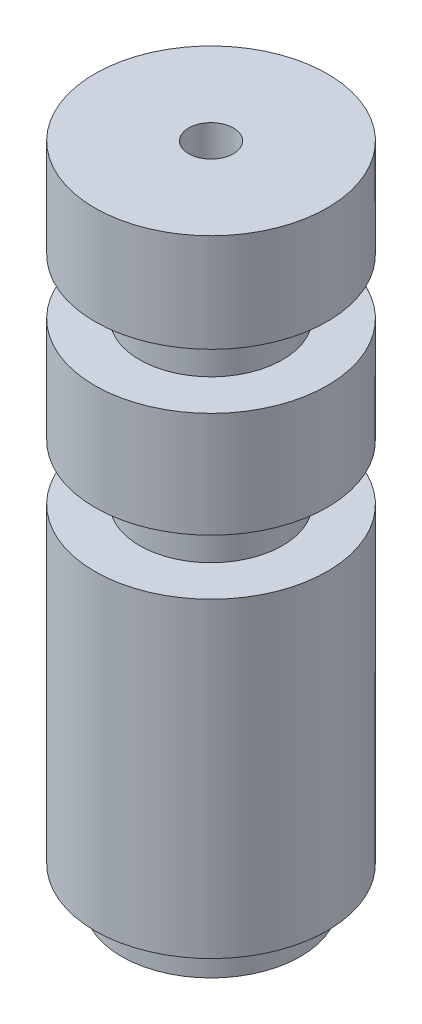
ISO-10303-21;
HEADER;
FILE_DESCRIPTION(('STEP AP214'),'2;1');
FILE_NAME('part.step','',(''),(''),'','','');
FILE_SCHEMA(('AUTOMOTIVE_DESIGN { 1 0 10303 214 1 1 1 1 }'));
ENDSEC;
DATA;
#1=APPLICATION_CONTEXT('core data for automotive mechanical design processes');
#2=APPLICATION_PROTOCOL_DEFINITION('international standard','automotive_design',2000,#1);
#3=PRODUCT_CONTEXT('',#1,'mechanical');
#4=PRODUCT('Part','Part','',(#3));
#5=PRODUCT_RELATED_PRODUCT_CATEGORY('part','',(#4));
#6=PRODUCT_DEFINITION_FORMATION('','',#4);
#7=PRODUCT_DEFINITION_CONTEXT('part definition',#1,'design');
#8=PRODUCT_DEFINITION('design','',#6,#7);
#9=PRODUCT_DEFINITION_SHAPE('','',#8);
#10=(LENGTH_UNIT() NAMED_UNIT(*) SI_UNIT(.MILLI.,.METRE.));
#11=(NAMED_UNIT(*) PLANE_ANGLE_UNIT() SI_UNIT($,.RADIAN.));
#12=(NAMED_UNIT(*) SI_UNIT($,.STERADIAN.) SOLID_ANGLE_UNIT());
#13=UNCERTAINTY_MEASURE_WITH_UNIT(LENGTH_MEASURE(1.E-05),#10,'distance_accuracy_value','');
#14=(GEOMETRIC_REPRESENTATION_CONTEXT(3) GLOBAL_UNCERTAINTY_ASSIGNED_CONTEXT((#13)) GLOBAL_UNIT_ASSIGNED_CONTEXT((#10,
#11,#12)) REPRESENTATION_CONTEXT('',''));
#15=CARTESIAN_POINT('',(0.,0.,0.));
#16=DIRECTION('',(0.,0.,1.));
#17=DIRECTION('',(1.,0.,0.));
#18=AXIS2_PLACEMENT_3D('',#15,#16,#17);
#19=CARTESIAN_POINT('',(0.,0.,0.));
#20=DIRECTION('',(0.,1.,0.));
#21=DIRECTION('',(0.,0.,1.));
#22=AXIS2_PLACEMENT_3D('',#19,#20,#21);
#23=PLANE('',#22);
#24=CARTESIAN_POINT('',(0.,0.,0.));
#25=DIRECTION('',(0.,1.,0.));
#26=DIRECTION('',(0.,0.,1.));
#27=AXIS2_PLACEMENT_3D('',#24,#25,#26);
#28=CIRCLE('',#27,6.5);
#29=CARTESIAN_POINT('',(0.,0.,6.5));
#30=VERTEX_POINT('',#29);
#31=EDGE_CURVE('E45',#30,#30,#28,.T.);
#32=ORIENTED_EDGE('',*,*,#31,.F.);
#33=EDGE_LOOP('',(#32));
#34=FACE_BOUND('',#33,.T.);
#35=CARTESIAN_POINT('',(0.,0.,0.));
#36=DIRECTION('',(0.,1.,0.));
#37=DIRECTION('',(0.,0.,1.));
#38=AXIS2_PLACEMENT_3D('',#35,#36,#37);
#39=CIRCLE('',#38,5.);
#40=CARTESIAN_POINT('',(0.,0.,5.));
#41=VERTEX_POINT('',#40);
#42=EDGE_CURVE('E11',#41,#41,#39,.F.);
#43=ORIENTED_EDGE('',*,*,#42,.F.);
#44=EDGE_LOOP('',(#43));
#45=FACE_BOUND('',#44,.T.);
#46=ADVANCED_FACE('F34',(#34,#45),#23,.F.);
#47=CARTESIAN_POINT('',(0.,35.,0.));
#48=DIRECTION('',(0.,-1.,0.));
#49=DIRECTION('',(0.,0.,-1.));
#50=AXIS2_PLACEMENT_3D('',#47,#48,#49);
#51=CYLINDRICAL_SURFACE('',#50,6.5);
#52=CARTESIAN_POINT('',(0.,20.5,0.));
#53=DIRECTION('',(0.,1.,0.));
#54=DIRECTION('',(0.,0.,1.));
#55=AXIS2_PLACEMENT_3D('',#52,#53,#54);
#56=CIRCLE('',#55,6.5);
#57=CARTESIAN_POINT('',(0.,20.5,6.5));
#58=VERTEX_POINT('',#57);
#59=EDGE_CURVE('E58',#58,#58,#56,.T.);
#60=ORIENTED_EDGE('',*,*,#59,.T.);
#61=EDGE_LOOP('',(#60));
#62=FACE_BOUND('',#61,.T.);
#63=CARTESIAN_POINT('',(0.,26.4,0.));
#64=DIRECTION('',(0.,1.,0.));
#65=DIRECTION('',(0.,0.,1.));
#66=AXIS2_PLACEMENT_3D('',#63,#64,#65);
#67=CIRCLE('',#66,6.5);
#68=CARTESIAN_POINT('',(0.,26.4,6.5));
#69=VERTEX_POINT('',#68);
#70=EDGE_CURVE('E62',#69,#69,#67,.T.);
#71=ORIENTED_EDGE('',*,*,#70,.F.);
#72=EDGE_LOOP('',(#71));
#73=FACE_BOUND('',#72,.T.);
#74=ADVANCED_FACE('F107',(#62,#73),#51,.T.);
#75=ORIENTED_EDGE('',*,*,#31,.T.);
#76=EDGE_LOOP('',(#75));
#77=FACE_BOUND('',#76,.T.);
#78=CARTESIAN_POINT('',(0.,17.4,0.));
#79=DIRECTION('',(0.,1.,0.));
#80=DIRECTION('',(0.,0.,1.));
#81=AXIS2_PLACEMENT_3D('',#78,#79,#80);
#82=CIRCLE('',#81,6.5);
#83=CARTESIAN_POINT('',(0.,17.4,6.5));
#84=VERTEX_POINT('',#83);
#85=EDGE_CURVE('E55',#84,#84,#82,.T.);
#86=ORIENTED_EDGE('',*,*,#85,.F.);
#87=EDGE_LOOP('',(#86));
#88=FACE_BOUND('',#87,.T.);
#89=ADVANCED_FACE('F112',(#77,#88),#51,.T.);
#90=CARTESIAN_POINT('',(0.,29.5,0.));
#91=DIRECTION('',(0.,1.,0.));
#92=DIRECTION('',(0.,0.,1.));
#93=AXIS2_PLACEMENT_3D('',#90,#91,#92);
#94=CIRCLE('',#93,6.5);
#95=CARTESIAN_POINT('',(0.,29.5,6.5));
#96=VERTEX_POINT('',#95);
#97=EDGE_CURVE('E64',#96,#96,#94,.T.);
#98=ORIENTED_EDGE('',*,*,#97,.T.);
#99=EDGE_LOOP('',(#98));
#100=FACE_BOUND('',#99,.T.);
#101=CARTESIAN_POINT('',(0.,35.,0.));
#102=DIRECTION('',(0.,1.,0.));
#103=DIRECTION('',(0.,0.,1.));
#104=AXIS2_PLACEMENT_3D('',#101,#102,#103);
#105=CIRCLE('',#104,6.5);
#106=CARTESIAN_POINT('',(0.,35.,6.5));
#107=VERTEX_POINT('',#106);
#108=EDGE_CURVE('E41',#107,#107,#105,.T.);
#109=ORIENTED_EDGE('',*,*,#108,.F.);
#110=EDGE_LOOP('',(#109));
#111=FACE_BOUND('',#110,.T.);
#112=ADVANCED_FACE('F36',(#100,#111),#51,.T.);
#113=CARTESIAN_POINT('',(0.,35.,0.));
#114=DIRECTION('',(0.,1.,0.));
#115=DIRECTION('',(0.,0.,1.));
#116=AXIS2_PLACEMENT_3D('',#113,#114,#115);
#117=PLANE('',#116);
#118=CARTESIAN_POINT('',(0.,35.,0.));
#119=DIRECTION('',(0.,-1.,0.));
#120=DIRECTION('',(0.,0.,-1.));
#121=AXIS2_PLACEMENT_3D('',#118,#119,#120);
#122=CIRCLE('',#121,1.25);
#123=CARTESIAN_POINT('',(0.,35.,-1.25));
#124=VERTEX_POINT('',#123);
#125=EDGE_CURVE('E50',#124,#124,#122,.T.);
#126=ORIENTED_EDGE('',*,*,#125,.T.);
#127=EDGE_LOOP('',(#126));
#128=FACE_BOUND('',#127,.T.);
#129=ORIENTED_EDGE('',*,*,#108,.T.);
#130=EDGE_LOOP('',(#129));
#131=FACE_BOUND('',#130,.T.);
#132=ADVANCED_FACE('F117',(#128,#131),#117,.T.);
#133=CARTESIAN_POINT('',(0.,35.,0.));
#134=DIRECTION('',(0.,-1.,0.));
#135=DIRECTION('',(0.,0.,-1.));
#136=AXIS2_PLACEMENT_3D('',#133,#134,#135);
#137=CYLINDRICAL_SURFACE('',#136,1.25);
#138=ORIENTED_EDGE('',*,*,#125,.F.);
#139=EDGE_LOOP('',(#138));
#140=FACE_BOUND('',#139,.T.);
#141=CARTESIAN_POINT('',(0.,-2.,0.));
#142=DIRECTION('',(0.,-1.,0.));
#143=DIRECTION('',(0.,0.,-1.));
#144=AXIS2_PLACEMENT_3D('',#141,#142,#143);
#145=CIRCLE('',#144,1.25);
#146=CARTESIAN_POINT('',(0.,-2.,-1.25));
#147=VERTEX_POINT('',#146);
#148=EDGE_CURVE('E84',#147,#147,#145,.T.);
#149=ORIENTED_EDGE('',*,*,#148,.T.);
#150=EDGE_LOOP('',(#149));
#151=FACE_BOUND('',#150,.T.);
#152=ADVANCED_FACE('F88',(#140,#151),#137,.F.);
#153=CARTESIAN_POINT('',(0.,20.5,0.));
#154=DIRECTION('',(0.,1.,0.));
#155=DIRECTION('',(0.,0.,1.));
#156=AXIS2_PLACEMENT_3D('',#153,#154,#155);
#157=PLANE('',#156);
#158=CARTESIAN_POINT('',(0.,20.5,0.));
#159=DIRECTION('',(0.,-1.,0.));
#160=DIRECTION('',(0.,0.,-1.));
#161=AXIS2_PLACEMENT_3D('',#158,#159,#160);
#162=CIRCLE('',#161,4.);
#163=CARTESIAN_POINT('',(0.,20.5,-4.));
#164=VERTEX_POINT('',#163);
#165=EDGE_CURVE('E67',#164,#164,#162,.T.);
#166=ORIENTED_EDGE('',*,*,#165,.F.);
#167=EDGE_LOOP('',(#166));
#168=FACE_BOUND('',#167,.T.);
#169=ORIENTED_EDGE('',*,*,#59,.F.);
#170=EDGE_LOOP('',(#169));
#171=FACE_BOUND('',#170,.T.);
#172=ADVANCED_FACE('F123',(#168,#171),#157,.F.);
#173=CARTESIAN_POINT('',(0.,17.4,0.));
#174=DIRECTION('',(0.,1.,0.));
#175=DIRECTION('',(0.,0.,1.));
#176=AXIS2_PLACEMENT_3D('',#173,#174,#175);
#177=PLANE('',#176);
#178=CARTESIAN_POINT('',(0.,17.4,0.));
#179=DIRECTION('',(0.,-1.,0.));
#180=DIRECTION('',(0.,0.,-1.));
#181=AXIS2_PLACEMENT_3D('',#178,#179,#180);
#182=CIRCLE('',#181,4.);
#183=CARTESIAN_POINT('',(0.,17.4,-4.));
#184=VERTEX_POINT('',#183);
#185=EDGE_CURVE('E59',#184,#184,#182,.T.);
#186=ORIENTED_EDGE('',*,*,#185,.T.);
#187=EDGE_LOOP('',(#186));
#188=FACE_BOUND('',#187,.T.);
#189=ORIENTED_EDGE('',*,*,#85,.T.);
#190=EDGE_LOOP('',(#189));
#191=FACE_BOUND('',#190,.T.);
#192=ADVANCED_FACE('F127',(#188,#191),#177,.T.);
#193=CARTESIAN_POINT('',(0.,20.5,0.));
#194=DIRECTION('',(0.,-1.,0.));
#195=DIRECTION('',(0.,0.,-1.));
#196=AXIS2_PLACEMENT_3D('',#193,#194,#195);
#197=CYLINDRICAL_SURFACE('',#196,4.);
#198=CARTESIAN_POINT('',(0.,20.5,-4.));
#199=CARTESIAN_POINT('',(0.,20.4677083333333,-4.));
#200=CARTESIAN_POINT('',(0.,20.4354166666667,-4.));
#201=CARTESIAN_POINT('',(0.,20.3708333333333,-4.));
#202=CARTESIAN_POINT('',(0.,20.3385416666667,-4.));
#203=CARTESIAN_POINT('',(0.,20.2739583333333,-4.));
#204=CARTESIAN_POINT('',(0.,20.2416666666667,-4.));
#205=CARTESIAN_POINT('',(0.,20.1770833333333,-4.));
#206=CARTESIAN_POINT('',(0.,20.1447916666667,-4.));
#207=CARTESIAN_POINT('',(0.,20.0802083333333,-4.));
#208=CARTESIAN_POINT('',(0.,20.0479166666667,-4.));
#209=CARTESIAN_POINT('',(0.,19.9833333333333,-4.));
#210=CARTESIAN_POINT('',(0.,19.9510416666667,-4.));
#211=CARTESIAN_POINT('',(0.,19.8864583333333,-4.));
#212=CARTESIAN_POINT('',(0.,19.8541666666667,-4.));
#213=CARTESIAN_POINT('',(0.,19.7895833333333,-4.));
#214=CARTESIAN_POINT('',(0.,19.7572916666667,-4.));
#215=CARTESIAN_POINT('',(0.,19.6927083333333,-4.));
#216=CARTESIAN_POINT('',(0.,19.6604166666667,-4.));
#217=CARTESIAN_POINT('',(0.,19.5958333333333,-4.));
#218=CARTESIAN_POINT('',(0.,19.5635416666667,-4.));
#219=CARTESIAN_POINT('',(0.,19.4989583333333,-4.));
#220=CARTESIAN_POINT('',(0.,19.4666666666667,-4.));
#221=CARTESIAN_POINT('',(0.,19.4020833333333,-4.));
#222=CARTESIAN_POINT('',(0.,19.3697916666667,-4.));
#223=CARTESIAN_POINT('',(0.,19.3052083333333,-4.));
#224=CARTESIAN_POINT('',(0.,19.2729166666667,-4.));
#225=CARTESIAN_POINT('',(0.,19.2083333333333,-4.));
#226=CARTESIAN_POINT('',(0.,19.1760416666667,-4.));
#227=CARTESIAN_POINT('',(0.,19.1114583333333,-4.));
#228=CARTESIAN_POINT('',(0.,19.0791666666667,-4.));
#229=CARTESIAN_POINT('',(0.,19.0145833333333,-4.));
#230=CARTESIAN_POINT('',(0.,18.9822916666667,-4.));
#231=CARTESIAN_POINT('',(0.,18.9177083333333,-4.));
#232=CARTESIAN_POINT('',(0.,18.8854166666667,-4.));
#233=CARTESIAN_POINT('',(0.,18.8208333333333,-4.));
#234=CARTESIAN_POINT('',(0.,18.7885416666667,-4.));
#235=CARTESIAN_POINT('',(0.,18.7239583333333,-4.));
#236=CARTESIAN_POINT('',(0.,18.6916666666667,-4.));
#237=CARTESIAN_POINT('',(0.,18.6270833333333,-4.));
#238=CARTESIAN_POINT('',(0.,18.5947916666667,-4.));
#239=CARTESIAN_POINT('',(0.,18.5302083333333,-4.));
#240=CARTESIAN_POINT('',(0.,18.4979166666667,-4.));
#241=CARTESIAN_POINT('',(0.,18.4333333333333,-4.));
#242=CARTESIAN_POINT('',(0.,18.4010416666667,-4.));
#243=CARTESIAN_POINT('',(0.,18.3364583333333,-4.));
#244=CARTESIAN_POINT('',(0.,18.3041666666667,-4.));
#245=CARTESIAN_POINT('',(0.,18.2395833333333,-4.));
#246=CARTESIAN_POINT('',(0.,18.2072916666667,-4.));
#247=CARTESIAN_POINT('',(0.,18.1427083333333,-4.));
#248=CARTESIAN_POINT('',(0.,18.1104166666667,-4.));
#249=CARTESIAN_POINT('',(0.,18.0458333333333,-4.));
#250=CARTESIAN_POINT('',(0.,18.0135416666667,-4.));
#251=CARTESIAN_POINT('',(0.,17.9489583333333,-4.));
#252=CARTESIAN_POINT('',(0.,17.9166666666667,-4.));
#253=CARTESIAN_POINT('',(0.,17.8520833333333,-4.));
#254=CARTESIAN_POINT('',(0.,17.8197916666667,-4.));
#255=CARTESIAN_POINT('',(0.,17.7552083333333,-4.));
#256=CARTESIAN_POINT('',(0.,17.7229166666667,-4.));
#257=CARTESIAN_POINT('',(0.,17.6583333333333,-4.));
#258=CARTESIAN_POINT('',(0.,17.6260416666667,-4.));
#259=CARTESIAN_POINT('',(0.,17.5614583333333,-4.));
#260=CARTESIAN_POINT('',(0.,17.5291666666667,-4.));
#261=CARTESIAN_POINT('',(0.,17.4645833333333,-4.));
#262=CARTESIAN_POINT('',(0.,17.4322916666667,-4.));
#263=CARTESIAN_POINT('',(0.,17.4,-4.));
#264=B_SPLINE_CURVE_WITH_KNOTS('',3,(#198,#199,#200,#201,#202,#203,#204,#205,#206,#207,#208,
#209,#210,#211,#212,#213,#214,#215,#216,#217,#218,#219,#220,#221,#222,#223,#224,#225,#226,#227,
#228,#229,#230,#231,#232,#233,#234,#235,#236,#237,#238,#239,#240,#241,#242,#243,#244,#245,#246,
#247,#248,#249,#250,#251,#252,#253,#254,#255,#256,#257,#258,#259,#260,#261,#262,#263),
.UNSPECIFIED.,.F.,.F.,(4,2,2,2,2,2,2,2,2,2,2,2,2,2,2,2,2,2,2,2,2,2,2,2,2,2,2,2,2,2,2,2,4),(0.,
0.0968750000000032,0.193750000000003,0.290625000000003,0.387500000000002,0.484375000000002,
0.581250000000002,0.678125000000002,0.775000000000001,0.871875000000001,0.968750000000001,
1.065625,1.1625,1.259375,1.35625,1.453125,1.55,1.646875,1.74375,1.840625,1.9375,2.034375,
2.13125,2.228125,2.325,2.421875,2.51875,2.615625,2.7125,2.809375,2.90625,3.003125,3.1),.UNSPECIFIED.);
#265=EDGE_CURVE('BSEAM131',#164,#184,#264,.T.);
#266=ORIENTED_EDGE('',*,*,#165,.T.);
#267=ORIENTED_EDGE('',*,*,#185,.F.);
#268=ORIENTED_EDGE('',*,*,#265,.T.);
#269=ORIENTED_EDGE('',*,*,#265,.F.);
#270=EDGE_LOOP('',(#266,#268,#267,#269));
#271=FACE_BOUND('',#270,.T.);
#272=ADVANCED_FACE('F131',(#271),#197,.T.);
#273=CARTESIAN_POINT('',(0.,29.5,0.));
#274=DIRECTION('',(0.,1.,0.));
#275=DIRECTION('',(0.,0.,1.));
#276=AXIS2_PLACEMENT_3D('',#273,#274,#275);
#277=PLANE('',#276);
#278=CARTESIAN_POINT('',(0.,29.5,0.));
#279=DIRECTION('',(0.,-1.,0.));
#280=DIRECTION('',(0.,0.,-1.));
#281=AXIS2_PLACEMENT_3D('',#278,#279,#280);
#282=CIRCLE('',#281,4.);
#283=CARTESIAN_POINT('',(0.,29.5,-4.));
#284=VERTEX_POINT('',#283);
#285=EDGE_CURVE('E78',#284,#284,#282,.T.);
#286=ORIENTED_EDGE('',*,*,#285,.F.);
#287=EDGE_LOOP('',(#286));
#288=FACE_BOUND('',#287,.T.);
#289=ORIENTED_EDGE('',*,*,#97,.F.);
#290=EDGE_LOOP('',(#289));
#291=FACE_BOUND('',#290,.T.);
#292=ADVANCED_FACE('F135',(#288,#291),#277,.F.);
#293=CARTESIAN_POINT('',(0.,26.4,0.));
#294=DIRECTION('',(0.,1.,0.));
#295=DIRECTION('',(0.,0.,1.));
#296=AXIS2_PLACEMENT_3D('',#293,#294,#295);
#297=PLANE('',#296);
#298=CARTESIAN_POINT('',(0.,26.4,0.));
#299=DIRECTION('',(0.,-1.,0.));
#300=DIRECTION('',(0.,0.,-1.));
#301=AXIS2_PLACEMENT_3D('',#298,#299,#300);
#302=CIRCLE('',#301,4.);
#303=CARTESIAN_POINT('',(0.,26.4,-4.));
#304=VERTEX_POINT('',#303);
#305=EDGE_CURVE('E65',#304,#304,#302,.T.);
#306=ORIENTED_EDGE('',*,*,#305,.T.);
#307=EDGE_LOOP('',(#306));
#308=FACE_BOUND('',#307,.T.);
#309=ORIENTED_EDGE('',*,*,#70,.T.);
#310=EDGE_LOOP('',(#309));
#311=FACE_BOUND('',#310,.T.);
#312=ADVANCED_FACE('F103',(#308,#311),#297,.T.);
#313=CARTESIAN_POINT('',(0.,29.5,0.));
#314=DIRECTION('',(0.,-1.,0.));
#315=DIRECTION('',(0.,0.,-1.));
#316=AXIS2_PLACEMENT_3D('',#313,#314,#315);
#317=CYLINDRICAL_SURFACE('',#316,4.);
#318=CARTESIAN_POINT('',(0.,29.5,-4.));
#319=CARTESIAN_POINT('',(0.,29.4677083333333,-4.));
#320=CARTESIAN_POINT('',(0.,29.4354166666667,-4.));
#321=CARTESIAN_POINT('',(0.,29.3708333333333,-4.));
#322=CARTESIAN_POINT('',(0.,29.3385416666667,-4.));
#323=CARTESIAN_POINT('',(0.,29.2739583333333,-4.));
#324=CARTESIAN_POINT('',(0.,29.2416666666667,-4.));
#325=CARTESIAN_POINT('',(0.,29.1770833333333,-4.));
#326=CARTESIAN_POINT('',(0.,29.1447916666667,-4.));
#327=CARTESIAN_POINT('',(0.,29.0802083333333,-4.));
#328=CARTESIAN_POINT('',(0.,29.0479166666667,-4.));
#329=CARTESIAN_POINT('',(0.,28.9833333333333,-4.));
#330=CARTESIAN_POINT('',(0.,28.9510416666667,-4.));
#331=CARTESIAN_POINT('',(0.,28.8864583333333,-4.));
#332=CARTESIAN_POINT('',(0.,28.8541666666667,-4.));
#333=CARTESIAN_POINT('',(0.,28.7895833333333,-4.));
#334=CARTESIAN_POINT('',(0.,28.7572916666667,-4.));
#335=CARTESIAN_POINT('',(0.,28.6927083333333,-4.));
#336=CARTESIAN_POINT('',(0.,28.6604166666667,-4.));
#337=CARTESIAN_POINT('',(0.,28.5958333333333,-4.));
#338=CARTESIAN_POINT('',(0.,28.5635416666667,-4.));
#339=CARTESIAN_POINT('',(0.,28.4989583333333,-4.));
#340=CARTESIAN_POINT('',(0.,28.4666666666667,-4.));
#341=CARTESIAN_POINT('',(0.,28.4020833333333,-4.));
#342=CARTESIAN_POINT('',(0.,28.3697916666667,-4.));
#343=CARTESIAN_POINT('',(0.,28.3052083333333,-4.));
#344=CARTESIAN_POINT('',(0.,28.2729166666667,-4.));
#345=CARTESIAN_POINT('',(0.,28.2083333333333,-4.));
#346=CARTESIAN_POINT('',(0.,28.1760416666667,-4.));
#347=CARTESIAN_POINT('',(0.,28.1114583333333,-4.));
#348=CARTESIAN_POINT('',(0.,28.0791666666667,-4.));
#349=CARTESIAN_POINT('',(0.,28.0145833333333,-4.));
#350=CARTESIAN_POINT('',(0.,27.9822916666667,-4.));
#351=CARTESIAN_POINT('',(0.,27.9177083333333,-4.));
#352=CARTESIAN_POINT('',(0.,27.8854166666667,-4.));
#353=CARTESIAN_POINT('',(0.,27.8208333333333,-4.));
#354=CARTESIAN_POINT('',(0.,27.7885416666667,-4.));
#355=CARTESIAN_POINT('',(0.,27.7239583333333,-4.));
#356=CARTESIAN_POINT('',(0.,27.6916666666667,-4.));
#357=CARTESIAN_POINT('',(0.,27.6270833333333,-4.));
#358=CARTESIAN_POINT('',(0.,27.5947916666667,-4.));
#359=CARTESIAN_POINT('',(0.,27.5302083333333,-4.));
#360=CARTESIAN_POINT('',(0.,27.4979166666667,-4.));
#361=CARTESIAN_POINT('',(0.,27.4333333333333,-4.));
#362=CARTESIAN_POINT('',(0.,27.4010416666667,-4.));
#363=CARTESIAN_POINT('',(0.,27.3364583333333,-4.));
#364=CARTESIAN_POINT('',(0.,27.3041666666667,-4.));
#365=CARTESIAN_POINT('',(0.,27.2395833333333,-4.));
#366=CARTESIAN_POINT('',(0.,27.2072916666667,-4.));
#367=CARTESIAN_POINT('',(0.,27.1427083333333,-4.));
#368=CARTESIAN_POINT('',(0.,27.1104166666667,-4.));
#369=CARTESIAN_POINT('',(0.,27.0458333333333,-4.));
#370=CARTESIAN_POINT('',(0.,27.0135416666667,-4.));
#371=CARTESIAN_POINT('',(0.,26.9489583333333,-4.));
#372=CARTESIAN_POINT('',(0.,26.9166666666667,-4.));
#373=CARTESIAN_POINT('',(0.,26.8520833333333,-4.));
#374=CARTESIAN_POINT('',(0.,26.8197916666667,-4.));
#375=CARTESIAN_POINT('',(0.,26.7552083333333,-4.));
#376=CARTESIAN_POINT('',(0.,26.7229166666667,-4.));
#377=CARTESIAN_POINT('',(0.,26.6583333333333,-4.));
#378=CARTESIAN_POINT('',(0.,26.6260416666667,-4.));
#379=CARTESIAN_POINT('',(0.,26.5614583333333,-4.));
#380=CARTESIAN_POINT('',(0.,26.5291666666667,-4.));
#381=CARTESIAN_POINT('',(0.,26.4645833333333,-4.));
#382=CARTESIAN_POINT('',(0.,26.4322916666667,-4.));
#383=CARTESIAN_POINT('',(0.,26.4,-4.));
#384=B_SPLINE_CURVE_WITH_KNOTS('',3,(#318,#319,#320,#321,#322,#323,#324,#325,#326,#327,#328,
#329,#330,#331,#332,#333,#334,#335,#336,#337,#338,#339,#340,#341,#342,#343,#344,#345,#346,#347,
#348,#349,#350,#351,#352,#353,#354,#355,#356,#357,#358,#359,#360,#361,#362,#363,#364,#365,#366,
#367,#368,#369,#370,#371,#372,#373,#374,#375,#376,#377,#378,#379,#380,#381,#382,#383),
.UNSPECIFIED.,.F.,.F.,(4,2,2,2,2,2,2,2,2,2,2,2,2,2,2,2,2,2,2,2,2,2,2,2,2,2,2,2,2,2,2,2,4),(0.,
0.0968750000000032,0.193750000000003,0.290625000000003,0.387500000000002,0.484375000000002,
0.581250000000002,0.678125000000002,0.775000000000001,0.871875000000001,0.968750000000001,
1.065625,1.1625,1.259375,1.35625,1.453125,1.55,1.646875,1.74375,1.840625,1.9375,2.034375,
2.13125,2.228125,2.325,2.421875,2.51875,2.615625,2.7125,2.809375,2.90625,3.003125,3.1),.UNSPECIFIED.);
#385=EDGE_CURVE('BSEAM98',#284,#304,#384,.T.);
#386=ORIENTED_EDGE('',*,*,#285,.T.);
#387=ORIENTED_EDGE('',*,*,#305,.F.);
#388=ORIENTED_EDGE('',*,*,#385,.T.);
#389=ORIENTED_EDGE('',*,*,#385,.F.);
#390=EDGE_LOOP('',(#386,#388,#387,#389));
#391=FACE_BOUND('',#390,.T.);
#392=ADVANCED_FACE('F98',(#391),#317,.T.);
#393=CARTESIAN_POINT('',(0.,-2.,0.));
#394=DIRECTION('',(0.,1.,0.));
#395=DIRECTION('',(0.,0.,1.));
#396=AXIS2_PLACEMENT_3D('',#393,#394,#395);
#397=CYLINDRICAL_SURFACE('',#396,5.);
#398=CARTESIAN_POINT('',(0.,-2.,0.));
#399=DIRECTION('',(0.,-1.,0.));
#400=DIRECTION('',(0.,0.,-1.));
#401=AXIS2_PLACEMENT_3D('',#398,#399,#400);
#402=CIRCLE('',#401,5.);
#403=CARTESIAN_POINT('',(0.,-2.,-5.));
#404=VERTEX_POINT('',#403);
#405=EDGE_CURVE('E81',#404,#404,#402,.T.);
#406=ORIENTED_EDGE('',*,*,#405,.F.);
#407=EDGE_LOOP('',(#406));
#408=FACE_BOUND('',#407,.T.);
#409=ORIENTED_EDGE('',*,*,#42,.T.);
#410=EDGE_LOOP('',(#409));
#411=FACE_BOUND('',#410,.T.);
#412=ADVANCED_FACE('F93',(#408,#411),#397,.T.);
#413=CARTESIAN_POINT('',(0.,-2.,0.));
#414=DIRECTION('',(0.,-1.,0.));
#415=DIRECTION('',(0.,0.,-1.));
#416=AXIS2_PLACEMENT_3D('',#413,#414,#415);
#417=PLANE('',#416);
#418=ORIENTED_EDGE('',*,*,#148,.F.);
#419=EDGE_LOOP('',(#418));
#420=FACE_BOUND('',#419,.T.);
#421=ORIENTED_EDGE('',*,*,#405,.T.);
#422=EDGE_LOOP('',(#421));
#423=FACE_BOUND('',#422,.T.);
#424=ADVANCED_FACE('F90',(#420,#423),#417,.T.);
#425=CLOSED_SHELL('',(#46,#74,#89,#112,#132,#152,#172,#192,#272,#292,#312,#392,#412,#424));
#426=MANIFOLD_SOLID_BREP('B2',#425);
#427=ADVANCED_BREP_SHAPE_REPRESENTATION('',(#18,#426),#14);
#428=SHAPE_DEFINITION_REPRESENTATION(#9,#427);
ENDSEC;
END-ISO-10303-21;
